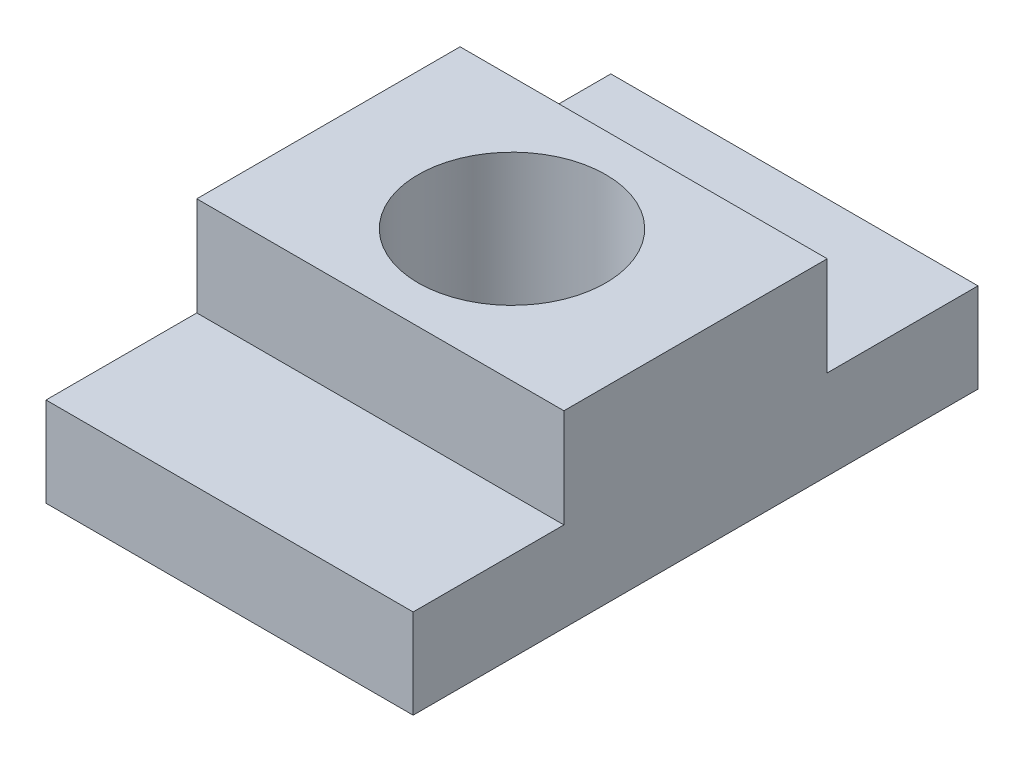
ISO-10303-21;
HEADER;
FILE_DESCRIPTION(('STEP AP214'),'2;1');
FILE_NAME('part.step','',(''),(''),'','','');
FILE_SCHEMA(('AUTOMOTIVE_DESIGN { 1 0 10303 214 1 1 1 1 }'));
ENDSEC;
DATA;
#1=APPLICATION_CONTEXT('core data for automotive mechanical design processes');
#2=APPLICATION_PROTOCOL_DEFINITION('international standard','automotive_design',2000,#1);
#3=PRODUCT_CONTEXT('',#1,'mechanical');
#4=PRODUCT('Part','Part','',(#3));
#5=PRODUCT_RELATED_PRODUCT_CATEGORY('part','',(#4));
#6=PRODUCT_DEFINITION_FORMATION('','',#4);
#7=PRODUCT_DEFINITION_CONTEXT('part definition',#1,'design');
#8=PRODUCT_DEFINITION('design','',#6,#7);
#9=PRODUCT_DEFINITION_SHAPE('','',#8);
#10=(LENGTH_UNIT() NAMED_UNIT(*) SI_UNIT(.MILLI.,.METRE.));
#11=(NAMED_UNIT(*) PLANE_ANGLE_UNIT() SI_UNIT($,.RADIAN.));
#12=(NAMED_UNIT(*) SI_UNIT($,.STERADIAN.) SOLID_ANGLE_UNIT());
#13=UNCERTAINTY_MEASURE_WITH_UNIT(LENGTH_MEASURE(1.E-05),#10,'distance_accuracy_value','');
#14=(GEOMETRIC_REPRESENTATION_CONTEXT(3) GLOBAL_UNCERTAINTY_ASSIGNED_CONTEXT((#13)) GLOBAL_UNIT_ASSIGNED_CONTEXT((#10,
#11,#12)) REPRESENTATION_CONTEXT('',''));
#15=CARTESIAN_POINT('',(0.,0.,0.));
#16=DIRECTION('',(0.,0.,1.));
#17=DIRECTION('',(1.,0.,0.));
#18=AXIS2_PLACEMENT_3D('',#15,#16,#17);
#19=CARTESIAN_POINT('',(0.,7.540625,0.));
#20=DIRECTION('',(0.,-1.,0.));
#21=DIRECTION('',(0.,0.,-1.));
#22=AXIS2_PLACEMENT_3D('',#19,#20,#21);
#23=PLANE('',#22);
#24=DIRECTION('',(-1.,0.,0.));
#25=VECTOR('',#24,1.);
#26=CARTESIAN_POINT('',(15.478125,7.540625,-11.0998));
#27=LINE('',#26,#25);
#28=CARTESIAN_POINT('',(15.478125,7.540625,-11.0998));
#29=VERTEX_POINT('',#28);
#30=CARTESIAN_POINT('',(-15.478125,7.540625,-11.0998));
#31=VERTEX_POINT('',#30);
#32=EDGE_CURVE('E48',#29,#31,#27,.T.);
#33=ORIENTED_EDGE('',*,*,#32,.F.);
#34=DIRECTION('',(0.,0.,-1.));
#35=VECTOR('',#34,1.);
#36=CARTESIAN_POINT('',(15.478125,7.540625,-23.8125));
#37=LINE('',#36,#35);
#38=CARTESIAN_POINT('',(15.478125,7.540625,-23.8125));
#39=VERTEX_POINT('',#38);
#40=EDGE_CURVE('E135',#29,#39,#37,.T.);
#41=ORIENTED_EDGE('',*,*,#40,.T.);
#42=DIRECTION('',(-1.,0.,0.));
#43=VECTOR('',#42,1.);
#44=CARTESIAN_POINT('',(15.478125,7.540625,-23.8125));
#45=LINE('',#44,#43);
#46=CARTESIAN_POINT('',(-15.478125,7.540625,-23.8125));
#47=VERTEX_POINT('',#46);
#48=EDGE_CURVE('E138',#39,#47,#45,.T.);
#49=ORIENTED_EDGE('',*,*,#48,.T.);
#50=DIRECTION('',(0.,0.,1.));
#51=VECTOR('',#50,1.);
#52=CARTESIAN_POINT('',(-15.478125,7.540625,-23.8125));
#53=LINE('',#52,#51);
#54=EDGE_CURVE('E131',#47,#31,#53,.T.);
#55=ORIENTED_EDGE('',*,*,#54,.T.);
#56=EDGE_LOOP('',(#33,#41,#49,#55));
#57=FACE_BOUND('',#56,.T.);
#58=ADVANCED_FACE('F33',(#57),#23,.F.);
#59=DIRECTION('',(1.,0.,0.));
#60=VECTOR('',#59,1.);
#61=CARTESIAN_POINT('',(15.478125,7.540625,11.0998));
#62=LINE('',#61,#60);
#63=CARTESIAN_POINT('',(-15.478125,7.540625,11.0998));
#64=VERTEX_POINT('',#63);
#65=CARTESIAN_POINT('',(15.478125,7.540625,11.0998));
#66=VERTEX_POINT('',#65);
#67=EDGE_CURVE('E56',#64,#66,#62,.T.);
#68=ORIENTED_EDGE('',*,*,#67,.F.);
#69=CARTESIAN_POINT('',(-15.478125,7.540625,23.8125));
#70=VERTEX_POINT('',#69);
#71=EDGE_CURVE('E121',#64,#70,#53,.T.);
#72=ORIENTED_EDGE('',*,*,#71,.T.);
#73=DIRECTION('',(1.,0.,0.));
#74=VECTOR('',#73,1.);
#75=CARTESIAN_POINT('',(15.478125,7.540625,23.8125));
#76=LINE('',#75,#74);
#77=CARTESIAN_POINT('',(15.478125,7.540625,23.8125));
#78=VERTEX_POINT('',#77);
#79=EDGE_CURVE('E133',#70,#78,#76,.T.);
#80=ORIENTED_EDGE('',*,*,#79,.T.);
#81=EDGE_CURVE('E136',#78,#66,#37,.T.);
#82=ORIENTED_EDGE('',*,*,#81,.T.);
#83=EDGE_LOOP('',(#68,#72,#80,#82));
#84=FACE_BOUND('',#83,.T.);
#85=ADVANCED_FACE('F198',(#84),#23,.F.);
#86=CARTESIAN_POINT('',(0.,0.,0.));
#87=DIRECTION('',(0.,-1.,0.));
#88=DIRECTION('',(0.,0.,-1.));
#89=AXIS2_PLACEMENT_3D('',#86,#87,#88);
#90=PLANE('',#89);
#91=DIRECTION('',(0.,0.,1.));
#92=VECTOR('',#91,1.);
#93=CARTESIAN_POINT('',(-15.478125,0.,-23.8125));
#94=LINE('',#93,#92);
#95=CARTESIAN_POINT('',(-15.478125,0.,-23.8125));
#96=VERTEX_POINT('',#95);
#97=CARTESIAN_POINT('',(-15.478125,0.,23.8125));
#98=VERTEX_POINT('',#97);
#99=EDGE_CURVE('E125',#96,#98,#94,.T.);
#100=ORIENTED_EDGE('',*,*,#99,.F.);
#101=DIRECTION('',(-1.,0.,0.));
#102=VECTOR('',#101,1.);
#103=CARTESIAN_POINT('',(15.478125,0.,-23.8125));
#104=LINE('',#103,#102);
#105=CARTESIAN_POINT('',(15.478125,0.,-23.8125));
#106=VERTEX_POINT('',#105);
#107=EDGE_CURVE('E146',#106,#96,#104,.T.);
#108=ORIENTED_EDGE('',*,*,#107,.F.);
#109=DIRECTION('',(0.,0.,-1.));
#110=VECTOR('',#109,1.);
#111=CARTESIAN_POINT('',(15.478125,0.,-23.8125));
#112=LINE('',#111,#110);
#113=CARTESIAN_POINT('',(15.478125,0.,23.8125));
#114=VERTEX_POINT('',#113);
#115=EDGE_CURVE('E144',#114,#106,#112,.T.);
#116=ORIENTED_EDGE('',*,*,#115,.F.);
#117=DIRECTION('',(1.,0.,0.));
#118=VECTOR('',#117,1.);
#119=CARTESIAN_POINT('',(15.478125,0.,23.8125));
#120=LINE('',#119,#118);
#121=EDGE_CURVE('E142',#98,#114,#120,.T.);
#122=ORIENTED_EDGE('',*,*,#121,.F.);
#123=EDGE_LOOP('',(#100,#108,#116,#122));
#124=FACE_BOUND('',#123,.T.);
#125=CARTESIAN_POINT('',(0.,0.,0.));
#126=DIRECTION('',(0.,1.,0.));
#127=DIRECTION('',(0.,0.,1.));
#128=AXIS2_PLACEMENT_3D('',#125,#126,#127);
#129=CIRCLE('',#128,7.9121);
#130=CARTESIAN_POINT('',(0.,0.,7.91209999999999));
#131=VERTEX_POINT('',#130);
#132=EDGE_CURVE('E122',#131,#131,#129,.T.);
#133=ORIENTED_EDGE('',*,*,#132,.T.);
#134=EDGE_LOOP('',(#133));
#135=FACE_BOUND('',#134,.T.);
#136=ADVANCED_FACE('F164',(#124,#135),#90,.T.);
#137=CARTESIAN_POINT('',(-15.478125,7.540625,-23.8125));
#138=DIRECTION('',(1.,0.,0.));
#139=DIRECTION('',(0.,0.,-1.));
#140=AXIS2_PLACEMENT_3D('',#137,#138,#139);
#141=PLANE('',#140);
#142=ORIENTED_EDGE('',*,*,#99,.T.);
#143=DIRECTION('',(0.,-1.,0.));
#144=VECTOR('',#143,1.);
#145=CARTESIAN_POINT('',(-15.478125,7.540625,23.8125));
#146=LINE('',#145,#144);
#147=EDGE_CURVE('E11',#70,#98,#146,.T.);
#148=ORIENTED_EDGE('',*,*,#147,.F.);
#149=ORIENTED_EDGE('',*,*,#71,.F.);
#150=DIRECTION('',(0.,-1.,0.));
#151=VECTOR('',#150,1.);
#152=CARTESIAN_POINT('',(-15.478125,15.875,11.0998));
#153=LINE('',#152,#151);
#154=CARTESIAN_POINT('',(-15.478125,15.875,11.0998));
#155=VERTEX_POINT('',#154);
#156=EDGE_CURVE('E102',#155,#64,#153,.T.);
#157=ORIENTED_EDGE('',*,*,#156,.F.);
#158=DIRECTION('',(0.,0.,1.));
#159=VECTOR('',#158,1.);
#160=CARTESIAN_POINT('',(-15.478125,15.875,11.0998));
#161=LINE('',#160,#159);
#162=CARTESIAN_POINT('',(-15.478125,15.875,-11.0998));
#163=VERTEX_POINT('',#162);
#164=EDGE_CURVE('E108',#163,#155,#161,.T.);
#165=ORIENTED_EDGE('',*,*,#164,.F.);
#166=DIRECTION('',(0.,-1.,0.));
#167=VECTOR('',#166,1.);
#168=CARTESIAN_POINT('',(-15.478125,15.875,-11.0998));
#169=LINE('',#168,#167);
#170=EDGE_CURVE('E171',#163,#31,#169,.T.);
#171=ORIENTED_EDGE('',*,*,#170,.T.);
#172=ORIENTED_EDGE('',*,*,#54,.F.);
#173=DIRECTION('',(0.,-1.,0.));
#174=VECTOR('',#173,1.);
#175=CARTESIAN_POINT('',(-15.478125,7.540625,-23.8125));
#176=LINE('',#175,#174);
#177=EDGE_CURVE('E140',#47,#96,#176,.T.);
#178=ORIENTED_EDGE('',*,*,#177,.T.);
#179=EDGE_LOOP('',(#142,#148,#149,#157,#165,#171,#172,#178));
#180=FACE_BOUND('',#179,.T.);
#181=ADVANCED_FACE('F35',(#180),#141,.F.);
#182=CARTESIAN_POINT('',(15.478125,7.540625,23.8125));
#183=DIRECTION('',(0.,0.,-1.));
#184=DIRECTION('',(-1.,0.,0.));
#185=AXIS2_PLACEMENT_3D('',#182,#183,#184);
#186=PLANE('',#185);
#187=ORIENTED_EDGE('',*,*,#121,.T.);
#188=DIRECTION('',(0.,-1.,0.));
#189=VECTOR('',#188,1.);
#190=CARTESIAN_POINT('',(15.478125,7.540625,23.8125));
#191=LINE('',#190,#189);
#192=EDGE_CURVE('E41',#78,#114,#191,.T.);
#193=ORIENTED_EDGE('',*,*,#192,.F.);
#194=ORIENTED_EDGE('',*,*,#79,.F.);
#195=ORIENTED_EDGE('',*,*,#147,.T.);
#196=EDGE_LOOP('',(#187,#193,#194,#195));
#197=FACE_BOUND('',#196,.T.);
#198=ADVANCED_FACE('F209',(#197),#186,.F.);
#199=CARTESIAN_POINT('',(15.478125,7.540625,-23.8125));
#200=DIRECTION('',(-1.,0.,0.));
#201=DIRECTION('',(0.,0.,1.));
#202=AXIS2_PLACEMENT_3D('',#199,#200,#201);
#203=PLANE('',#202);
#204=ORIENTED_EDGE('',*,*,#115,.T.);
#205=DIRECTION('',(0.,-1.,0.));
#206=VECTOR('',#205,1.);
#207=CARTESIAN_POINT('',(15.478125,7.540625,-23.8125));
#208=LINE('',#207,#206);
#209=EDGE_CURVE('E150',#39,#106,#208,.T.);
#210=ORIENTED_EDGE('',*,*,#209,.F.);
#211=ORIENTED_EDGE('',*,*,#40,.F.);
#212=DIRECTION('',(0.,-1.,0.));
#213=VECTOR('',#212,1.);
#214=CARTESIAN_POINT('',(15.478125,15.875,-11.0998));
#215=LINE('',#214,#213);
#216=CARTESIAN_POINT('',(15.478125,15.875,-11.0998));
#217=VERTEX_POINT('',#216);
#218=EDGE_CURVE('E127',#217,#29,#215,.T.);
#219=ORIENTED_EDGE('',*,*,#218,.F.);
#220=DIRECTION('',(0.,0.,-1.));
#221=VECTOR('',#220,1.);
#222=CARTESIAN_POINT('',(15.478125,15.875,11.0998));
#223=LINE('',#222,#221);
#224=CARTESIAN_POINT('',(15.478125,15.875,11.0998));
#225=VERTEX_POINT('',#224);
#226=EDGE_CURVE('E107',#225,#217,#223,.T.);
#227=ORIENTED_EDGE('',*,*,#226,.F.);
#228=DIRECTION('',(0.,-1.,0.));
#229=VECTOR('',#228,1.);
#230=CARTESIAN_POINT('',(15.478125,15.875,11.0998));
#231=LINE('',#230,#229);
#232=EDGE_CURVE('E104',#225,#66,#231,.T.);
#233=ORIENTED_EDGE('',*,*,#232,.T.);
#234=ORIENTED_EDGE('',*,*,#81,.F.);
#235=ORIENTED_EDGE('',*,*,#192,.T.);
#236=EDGE_LOOP('',(#204,#210,#211,#219,#227,#233,#234,#235));
#237=FACE_BOUND('',#236,.T.);
#238=ADVANCED_FACE('F157',(#237),#203,.F.);
#239=CARTESIAN_POINT('',(15.478125,7.540625,-23.8125));
#240=DIRECTION('',(0.,0.,1.));
#241=DIRECTION('',(1.,0.,0.));
#242=AXIS2_PLACEMENT_3D('',#239,#240,#241);
#243=PLANE('',#242);
#244=ORIENTED_EDGE('',*,*,#107,.T.);
#245=ORIENTED_EDGE('',*,*,#177,.F.);
#246=ORIENTED_EDGE('',*,*,#48,.F.);
#247=ORIENTED_EDGE('',*,*,#209,.T.);
#248=EDGE_LOOP('',(#244,#245,#246,#247));
#249=FACE_BOUND('',#248,.T.);
#250=ADVANCED_FACE('F168',(#249),#243,.F.);
#251=CARTESIAN_POINT('',(0.,7.540625,0.));
#252=DIRECTION('',(0.,-1.,0.));
#253=DIRECTION('',(0.,0.,-1.));
#254=AXIS2_PLACEMENT_3D('',#251,#252,#253);
#255=CYLINDRICAL_SURFACE('',#254,7.9121);
#256=ORIENTED_EDGE('',*,*,#132,.F.);
#257=EDGE_LOOP('',(#256));
#258=FACE_BOUND('',#257,.T.);
#259=CARTESIAN_POINT('',(0.,15.875,0.));
#260=DIRECTION('',(0.,1.,0.));
#261=DIRECTION('',(0.,0.,1.));
#262=AXIS2_PLACEMENT_3D('',#259,#260,#261);
#263=CIRCLE('',#262,7.9121);
#264=CARTESIAN_POINT('',(0.,15.875,7.91209999999999));
#265=VERTEX_POINT('',#264);
#266=EDGE_CURVE('E177',#265,#265,#263,.T.);
#267=ORIENTED_EDGE('',*,*,#266,.T.);
#268=EDGE_LOOP('',(#267));
#269=FACE_BOUND('',#268,.T.);
#270=ADVANCED_FACE('F186',(#258,#269),#255,.F.);
#271=CARTESIAN_POINT('',(0.,15.875,0.));
#272=DIRECTION('',(0.,1.,0.));
#273=DIRECTION('',(0.,0.,1.));
#274=AXIS2_PLACEMENT_3D('',#271,#272,#273);
#275=PLANE('',#274);
#276=ORIENTED_EDGE('',*,*,#164,.T.);
#277=DIRECTION('',(1.,0.,0.));
#278=VECTOR('',#277,1.);
#279=CARTESIAN_POINT('',(15.478125,15.875,11.0998));
#280=LINE('',#279,#278);
#281=EDGE_CURVE('E98',#155,#225,#280,.T.);
#282=ORIENTED_EDGE('',*,*,#281,.T.);
#283=ORIENTED_EDGE('',*,*,#226,.T.);
#284=DIRECTION('',(-1.,0.,0.));
#285=VECTOR('',#284,1.);
#286=CARTESIAN_POINT('',(15.478125,15.875,-11.0998));
#287=LINE('',#286,#285);
#288=EDGE_CURVE('E114',#217,#163,#287,.T.);
#289=ORIENTED_EDGE('',*,*,#288,.T.);
#290=EDGE_LOOP('',(#276,#282,#283,#289));
#291=FACE_BOUND('',#290,.T.);
#292=ORIENTED_EDGE('',*,*,#266,.F.);
#293=EDGE_LOOP('',(#292));
#294=FACE_BOUND('',#293,.T.);
#295=ADVANCED_FACE('F111',(#291,#294),#275,.T.);
#296=CARTESIAN_POINT('',(15.478125,15.875,11.0998));
#297=DIRECTION('',(0.,0.,-1.));
#298=DIRECTION('',(-1.,0.,0.));
#299=AXIS2_PLACEMENT_3D('',#296,#297,#298);
#300=PLANE('',#299);
#301=ORIENTED_EDGE('',*,*,#67,.T.);
#302=ORIENTED_EDGE('',*,*,#232,.F.);
#303=ORIENTED_EDGE('',*,*,#281,.F.);
#304=ORIENTED_EDGE('',*,*,#156,.T.);
#305=EDGE_LOOP('',(#301,#302,#303,#304));
#306=FACE_BOUND('',#305,.T.);
#307=ADVANCED_FACE('F100',(#306),#300,.F.);
#308=CARTESIAN_POINT('',(15.478125,15.875,-11.0998));
#309=DIRECTION('',(0.,0.,1.));
#310=DIRECTION('',(1.,0.,0.));
#311=AXIS2_PLACEMENT_3D('',#308,#309,#310);
#312=PLANE('',#311);
#313=ORIENTED_EDGE('',*,*,#32,.T.);
#314=ORIENTED_EDGE('',*,*,#170,.F.);
#315=ORIENTED_EDGE('',*,*,#288,.F.);
#316=ORIENTED_EDGE('',*,*,#218,.T.);
#317=EDGE_LOOP('',(#313,#314,#315,#316));
#318=FACE_BOUND('',#317,.T.);
#319=ADVANCED_FACE('F174',(#318),#312,.F.);
#320=CLOSED_SHELL('',(#58,#85,#136,#181,#198,#238,#250,#270,#295,#307,#319));
#321=MANIFOLD_SOLID_BREP('B2',#320);
#322=ADVANCED_BREP_SHAPE_REPRESENTATION('',(#18,#321),#14);
#323=SHAPE_DEFINITION_REPRESENTATION(#9,#322);
ENDSEC;
END-ISO-10303-21;
